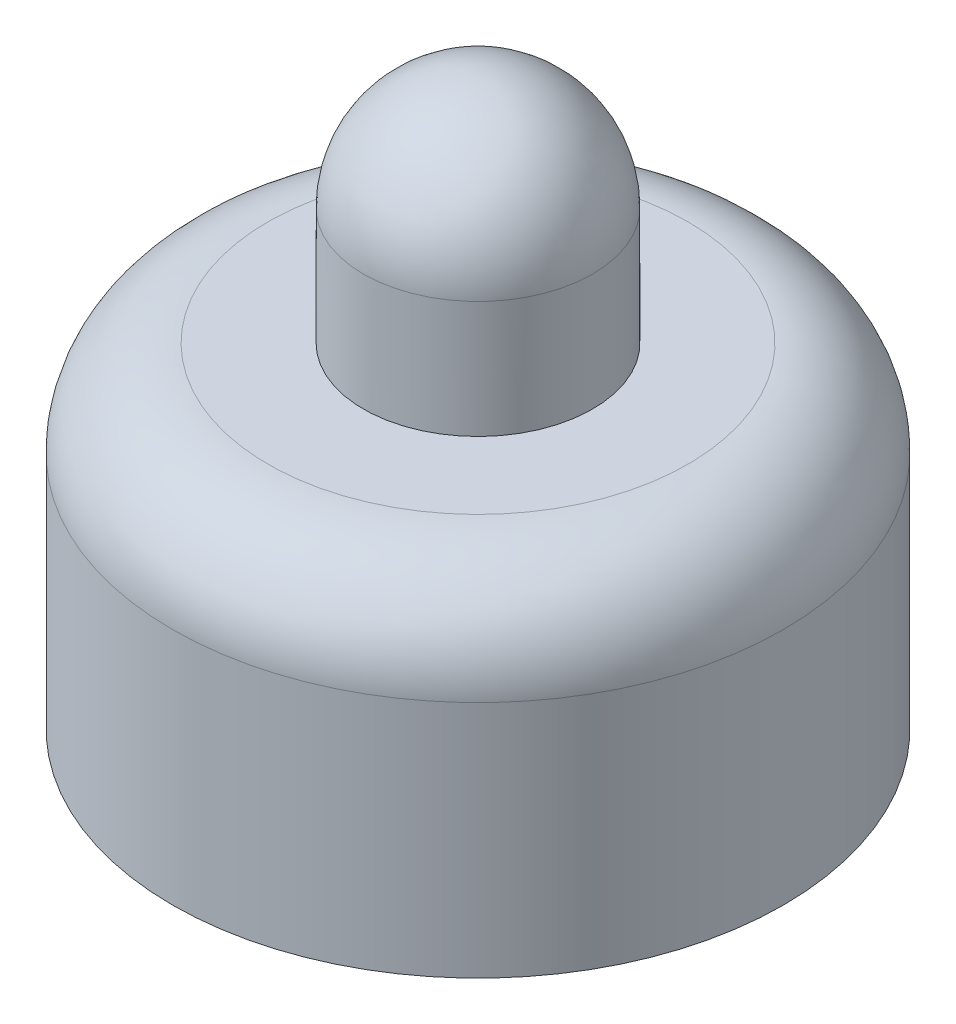
ISO-10303-21;
HEADER;
FILE_DESCRIPTION(('STEP AP214'),'2;1');
FILE_NAME('part.step','',(''),(''),'','','');
FILE_SCHEMA(('AUTOMOTIVE_DESIGN { 1 0 10303 214 1 1 1 1 }'));
ENDSEC;
DATA;
#1=APPLICATION_CONTEXT('core data for automotive mechanical design processes');
#2=APPLICATION_PROTOCOL_DEFINITION('international standard','automotive_design',2000,#1);
#3=PRODUCT_CONTEXT('',#1,'mechanical');
#4=PRODUCT('Part','Part','',(#3));
#5=PRODUCT_RELATED_PRODUCT_CATEGORY('part','',(#4));
#6=PRODUCT_DEFINITION_FORMATION('','',#4);
#7=PRODUCT_DEFINITION_CONTEXT('part definition',#1,'design');
#8=PRODUCT_DEFINITION('design','',#6,#7);
#9=PRODUCT_DEFINITION_SHAPE('','',#8);
#10=(LENGTH_UNIT() NAMED_UNIT(*) SI_UNIT(.MILLI.,.METRE.));
#11=(NAMED_UNIT(*) PLANE_ANGLE_UNIT() SI_UNIT($,.RADIAN.));
#12=(NAMED_UNIT(*) SI_UNIT($,.STERADIAN.) SOLID_ANGLE_UNIT());
#13=UNCERTAINTY_MEASURE_WITH_UNIT(LENGTH_MEASURE(1.E-05),#10,'distance_accuracy_value','');
#14=(GEOMETRIC_REPRESENTATION_CONTEXT(3) GLOBAL_UNCERTAINTY_ASSIGNED_CONTEXT((#13)) GLOBAL_UNIT_ASSIGNED_CONTEXT((#10,
#11,#12)) REPRESENTATION_CONTEXT('',''));
#15=CARTESIAN_POINT('',(0.,0.,0.));
#16=DIRECTION('',(0.,0.,1.));
#17=DIRECTION('',(1.,0.,0.));
#18=AXIS2_PLACEMENT_3D('',#15,#16,#17);
#19=CARTESIAN_POINT('',(0.,0.,0.));
#20=DIRECTION('',(0.,-1.,0.));
#21=DIRECTION('',(0.,0.,-1.));
#22=AXIS2_PLACEMENT_3D('',#19,#20,#21);
#23=CYLINDRICAL_SURFACE('',#22,2.4);
#24=CARTESIAN_POINT('',(0.,14.3357142857143,0.));
#25=DIRECTION('',(0.,-1.,0.));
#26=DIRECTION('',(0.,0.,-1.));
#27=AXIS2_PLACEMENT_3D('',#24,#25,#26);
#28=CIRCLE('',#27,2.4);
#29=CARTESIAN_POINT('',(0.,14.3357142857143,-2.4));
#30=VERTEX_POINT('',#29);
#31=EDGE_CURVE('E67',#30,#30,#28,.T.);
#32=ORIENTED_EDGE('',*,*,#31,.F.);
#33=EDGE_LOOP('',(#32));
#34=FACE_BOUND('',#33,.T.);
#35=CARTESIAN_POINT('',(0.,16.7857142857143,0.));
#36=DIRECTION('',(0.,-1.,0.));
#37=DIRECTION('',(0.,0.,-1.));
#38=AXIS2_PLACEMENT_3D('',#35,#36,#37);
#39=CIRCLE('',#38,2.4);
#40=CARTESIAN_POINT('',(0.,16.7857142857143,-2.4));
#41=VERTEX_POINT('',#40);
#42=EDGE_CURVE('E56',#41,#41,#39,.T.);
#43=ORIENTED_EDGE('',*,*,#42,.T.);
#44=EDGE_LOOP('',(#43));
#45=FACE_BOUND('',#44,.T.);
#46=ADVANCED_FACE('F43',(#34,#45),#23,.T.);
#47=CARTESIAN_POINT('',(0.,16.7857142857143,0.));
#48=DIRECTION('',(0.,-1.,0.));
#49=DIRECTION('',(1.,0.,0.));
#50=AXIS2_PLACEMENT_3D('',#47,#48,#49);
#51=SPHERICAL_SURFACE('',#50,2.4);
#52=ORIENTED_EDGE('',*,*,#42,.F.);
#53=EDGE_LOOP('',(#52));
#54=FACE_BOUND('',#53,.T.);
#55=ADVANCED_FACE('F76',(#54),#51,.T.);
#56=CARTESIAN_POINT('',(0.,7.33571428571428,0.));
#57=DIRECTION('',(0.,1.,0.));
#58=DIRECTION('',(0.,0.,1.));
#59=AXIS2_PLACEMENT_3D('',#56,#57,#58);
#60=PLANE('',#59);
#61=CARTESIAN_POINT('',(0.,7.33571428571428,0.));
#62=DIRECTION('',(0.,-1.,0.));
#63=DIRECTION('',(0.,0.,-1.));
#64=AXIS2_PLACEMENT_3D('',#61,#62,#63);
#65=CIRCLE('',#64,6.4);
#66=CARTESIAN_POINT('',(0.,7.33571428571428,-6.4));
#67=VERTEX_POINT('',#66);
#68=EDGE_CURVE('E61',#67,#67,#65,.T.);
#69=ORIENTED_EDGE('',*,*,#68,.T.);
#70=EDGE_LOOP('',(#69));
#71=FACE_BOUND('',#70,.T.);
#72=ADVANCED_FACE('F80',(#71),#60,.F.);
#73=CARTESIAN_POINT('',(0.,0.,0.));
#74=DIRECTION('',(0.,-1.,0.));
#75=DIRECTION('',(0.,0.,-1.));
#76=AXIS2_PLACEMENT_3D('',#73,#74,#75);
#77=CYLINDRICAL_SURFACE('',#76,6.4);
#78=CARTESIAN_POINT('',(0.,12.3357142857143,0.));
#79=DIRECTION('',(0.,-1.,0.));
#80=DIRECTION('',(0.,0.,-1.));
#81=AXIS2_PLACEMENT_3D('',#78,#79,#80);
#82=CIRCLE('',#81,6.4);
#83=CARTESIAN_POINT('',(0.,12.3357142857143,-6.4));
#84=VERTEX_POINT('',#83);
#85=EDGE_CURVE('E51',#84,#84,#82,.T.);
#86=ORIENTED_EDGE('',*,*,#85,.T.);
#87=EDGE_LOOP('',(#86));
#88=FACE_BOUND('',#87,.T.);
#89=ORIENTED_EDGE('',*,*,#68,.F.);
#90=EDGE_LOOP('',(#89));
#91=FACE_BOUND('',#90,.T.);
#92=ADVANCED_FACE('F85',(#88,#91),#77,.T.);
#93=CARTESIAN_POINT('',(0.,14.3357142857143,0.));
#94=DIRECTION('',(0.,-1.,0.));
#95=DIRECTION('',(0.,0.,-1.));
#96=AXIS2_PLACEMENT_3D('',#93,#94,#95);
#97=PLANE('',#96);
#98=CARTESIAN_POINT('',(0.,14.3357142857143,0.));
#99=DIRECTION('',(0.,-1.,0.));
#100=DIRECTION('',(0.,0.,-1.));
#101=AXIS2_PLACEMENT_3D('',#98,#99,#100);
#102=CIRCLE('',#101,4.4);
#103=CARTESIAN_POINT('',(0.,14.3357142857143,-4.4));
#104=VERTEX_POINT('',#103);
#105=EDGE_CURVE('E10',#104,#104,#102,.F.);
#106=ORIENTED_EDGE('',*,*,#105,.T.);
#107=EDGE_LOOP('',(#106));
#108=FACE_BOUND('',#107,.T.);
#109=ORIENTED_EDGE('',*,*,#31,.T.);
#110=EDGE_LOOP('',(#109));
#111=FACE_BOUND('',#110,.T.);
#112=ADVANCED_FACE('F72',(#108,#111),#97,.F.);
#113=CARTESIAN_POINT('',(0.,12.3357142857143,0.));
#114=DIRECTION('',(0.,-1.,0.));
#115=DIRECTION('',(0.,0.,-1.));
#116=AXIS2_PLACEMENT_3D('',#113,#114,#115);
#117=TOROIDAL_SURFACE('',#116,4.4,2.);
#118=ORIENTED_EDGE('',*,*,#105,.F.);
#119=EDGE_LOOP('',(#118));
#120=FACE_BOUND('',#119,.T.);
#121=ORIENTED_EDGE('',*,*,#85,.F.);
#122=EDGE_LOOP('',(#121));
#123=FACE_BOUND('',#122,.T.);
#124=ADVANCED_FACE('F45',(#120,#123),#117,.T.);
#125=CLOSED_SHELL('',(#46,#55,#72,#92,#112,#124));
#126=MANIFOLD_SOLID_BREP('B2',#125);
#127=ADVANCED_BREP_SHAPE_REPRESENTATION('',(#18,#126),#14);
#128=SHAPE_DEFINITION_REPRESENTATION(#9,#127);
ENDSEC;
END-ISO-10303-21;
